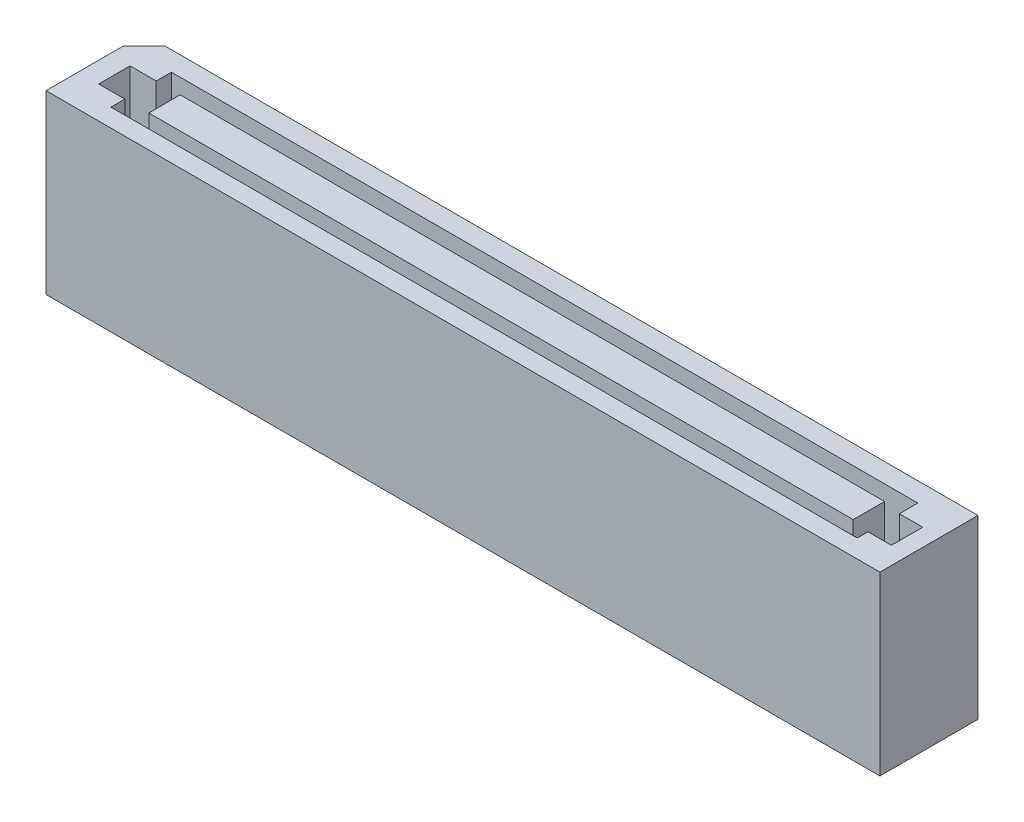
ISO-10303-21;
HEADER;
FILE_DESCRIPTION(('STEP AP214'),'2;1');
FILE_NAME('part.step','',(''),(''),'','','');
FILE_SCHEMA(('AUTOMOTIVE_DESIGN { 1 0 10303 214 1 1 1 1 }'));
ENDSEC;
DATA;
#1=APPLICATION_CONTEXT('core data for automotive mechanical design processes');
#2=APPLICATION_PROTOCOL_DEFINITION('international standard','automotive_design',2000,#1);
#3=PRODUCT_CONTEXT('',#1,'mechanical');
#4=PRODUCT('Part','Part','',(#3));
#5=PRODUCT_RELATED_PRODUCT_CATEGORY('part','',(#4));
#6=PRODUCT_DEFINITION_FORMATION('','',#4);
#7=PRODUCT_DEFINITION_CONTEXT('part definition',#1,'design');
#8=PRODUCT_DEFINITION('design','',#6,#7);
#9=PRODUCT_DEFINITION_SHAPE('','',#8);
#10=(LENGTH_UNIT() NAMED_UNIT(*) SI_UNIT(.MILLI.,.METRE.));
#11=(NAMED_UNIT(*) PLANE_ANGLE_UNIT() SI_UNIT($,.RADIAN.));
#12=(NAMED_UNIT(*) SI_UNIT($,.STERADIAN.) SOLID_ANGLE_UNIT());
#13=UNCERTAINTY_MEASURE_WITH_UNIT(LENGTH_MEASURE(1.E-05),#10,'distance_accuracy_value','');
#14=(GEOMETRIC_REPRESENTATION_CONTEXT(3) GLOBAL_UNCERTAINTY_ASSIGNED_CONTEXT((#13)) GLOBAL_UNIT_ASSIGNED_CONTEXT((#10,
#11,#12)) REPRESENTATION_CONTEXT('',''));
#15=CARTESIAN_POINT('',(0.,0.,0.));
#16=DIRECTION('',(0.,0.,1.));
#17=DIRECTION('',(1.,0.,0.));
#18=AXIS2_PLACEMENT_3D('',#15,#16,#17);
#19=CARTESIAN_POINT('',(21.25,9.,1.43999999999998));
#20=DIRECTION('',(-1.,0.,0.));
#21=DIRECTION('',(0.,0.,1.));
#22=AXIS2_PLACEMENT_3D('',#19,#20,#21);
#23=PLANE('',#22);
#24=DIRECTION('',(0.,0.,-1.));
#25=VECTOR('',#24,1.);
#26=CARTESIAN_POINT('',(21.25,0.,1.43999999999998));
#27=LINE('',#26,#25);
#28=CARTESIAN_POINT('',(21.25,0.,2.5));
#29=VERTEX_POINT('',#28);
#30=CARTESIAN_POINT('',(21.25,0.,-2.5));
#31=VERTEX_POINT('',#30);
#32=EDGE_CURVE('E290',#29,#31,#27,.T.);
#33=ORIENTED_EDGE('',*,*,#32,.T.);
#34=DIRECTION('',(0.,-1.,0.));
#35=VECTOR('',#34,1.);
#36=CARTESIAN_POINT('',(21.25,9.,-2.5));
#37=LINE('',#36,#35);
#38=CARTESIAN_POINT('',(21.25,9.,-2.5));
#39=VERTEX_POINT('',#38);
#40=EDGE_CURVE('E11',#39,#31,#37,.T.);
#41=ORIENTED_EDGE('',*,*,#40,.F.);
#42=DIRECTION('',(0.,0.,-1.));
#43=VECTOR('',#42,1.);
#44=CARTESIAN_POINT('',(21.25,9.,2.5));
#45=LINE('',#44,#43);
#46=CARTESIAN_POINT('',(21.25,9.,2.5));
#47=VERTEX_POINT('',#46);
#48=EDGE_CURVE('E312',#47,#39,#45,.T.);
#49=ORIENTED_EDGE('',*,*,#48,.F.);
#50=DIRECTION('',(0.,-1.,0.));
#51=VECTOR('',#50,1.);
#52=CARTESIAN_POINT('',(21.25,9.,2.5));
#53=LINE('',#52,#51);
#54=EDGE_CURVE('E323',#47,#29,#53,.T.);
#55=ORIENTED_EDGE('',*,*,#54,.T.);
#56=EDGE_LOOP('',(#33,#41,#49,#55));
#57=FACE_BOUND('',#56,.T.);
#58=ADVANCED_FACE('F34',(#57),#23,.F.);
#59=CARTESIAN_POINT('',(-20.189,9.,-2.5));
#60=DIRECTION('',(0.,0.,1.));
#61=DIRECTION('',(1.,0.,0.));
#62=AXIS2_PLACEMENT_3D('',#59,#60,#61);
#63=PLANE('',#62);
#64=DIRECTION('',(-1.,0.,0.));
#65=VECTOR('',#64,1.);
#66=CARTESIAN_POINT('',(-20.189,0.,-2.5));
#67=LINE('',#66,#65);
#68=CARTESIAN_POINT('',(-20.189,0.,-2.5));
#69=VERTEX_POINT('',#68);
#70=EDGE_CURVE('E325',#31,#69,#67,.T.);
#71=ORIENTED_EDGE('',*,*,#70,.T.);
#72=DIRECTION('',(0.,-1.,0.));
#73=VECTOR('',#72,1.);
#74=CARTESIAN_POINT('',(-20.189,9.,-2.5));
#75=LINE('',#74,#73);
#76=CARTESIAN_POINT('',(-20.189,9.,-2.5));
#77=VERTEX_POINT('',#76);
#78=EDGE_CURVE('E41',#77,#69,#75,.T.);
#79=ORIENTED_EDGE('',*,*,#78,.F.);
#80=DIRECTION('',(-1.,0.,0.));
#81=VECTOR('',#80,1.);
#82=CARTESIAN_POINT('',(-20.189,9.,-2.5));
#83=LINE('',#82,#81);
#84=EDGE_CURVE('E314',#39,#77,#83,.T.);
#85=ORIENTED_EDGE('',*,*,#84,.F.);
#86=ORIENTED_EDGE('',*,*,#40,.T.);
#87=EDGE_LOOP('',(#71,#79,#85,#86));
#88=FACE_BOUND('',#87,.T.);
#89=ADVANCED_FACE('F366',(#88),#63,.F.);
#90=CARTESIAN_POINT('',(-21.25,9.,-1.43900000000004));
#91=DIRECTION('',(0.707106781186547,0.,0.707106781186547));
#92=DIRECTION('',(0.707106781186548,0.,-0.707106781186548));
#93=AXIS2_PLACEMENT_3D('',#90,#91,#92);
#94=PLANE('',#93);
#95=DIRECTION('',(-0.707106781186548,0.,0.707106781186548));
#96=VECTOR('',#95,1.);
#97=CARTESIAN_POINT('',(-21.25,0.,-1.43900000000004));
#98=LINE('',#97,#96);
#99=CARTESIAN_POINT('',(-21.25,0.,-1.43900000000004));
#100=VERTEX_POINT('',#99);
#101=EDGE_CURVE('E327',#69,#100,#98,.T.);
#102=ORIENTED_EDGE('',*,*,#101,.T.);
#103=DIRECTION('',(0.,-1.,0.));
#104=VECTOR('',#103,1.);
#105=CARTESIAN_POINT('',(-21.25,9.,-1.43900000000004));
#106=LINE('',#105,#104);
#107=CARTESIAN_POINT('',(-21.25,9.,-1.43900000000004));
#108=VERTEX_POINT('',#107);
#109=EDGE_CURVE('E339',#108,#100,#106,.T.);
#110=ORIENTED_EDGE('',*,*,#109,.F.);
#111=DIRECTION('',(-0.707106781186548,0.,0.707106781186548));
#112=VECTOR('',#111,1.);
#113=CARTESIAN_POINT('',(-21.25,9.,-1.43900000000004));
#114=LINE('',#113,#112);
#115=EDGE_CURVE('E317',#77,#108,#114,.T.);
#116=ORIENTED_EDGE('',*,*,#115,.F.);
#117=ORIENTED_EDGE('',*,*,#78,.T.);
#118=EDGE_LOOP('',(#102,#110,#116,#117));
#119=FACE_BOUND('',#118,.T.);
#120=ADVANCED_FACE('F346',(#119),#94,.F.);
#121=CARTESIAN_POINT('',(-21.25,9.,-1.43900000000004));
#122=DIRECTION('',(1.,0.,0.));
#123=DIRECTION('',(0.,0.,-1.));
#124=AXIS2_PLACEMENT_3D('',#121,#122,#123);
#125=PLANE('',#124);
#126=DIRECTION('',(0.,0.,1.));
#127=VECTOR('',#126,1.);
#128=CARTESIAN_POINT('',(-21.25,0.,-1.43900000000004));
#129=LINE('',#128,#127);
#130=CARTESIAN_POINT('',(-21.25,0.,2.5));
#131=VERTEX_POINT('',#130);
#132=EDGE_CURVE('E329',#100,#131,#129,.T.);
#133=ORIENTED_EDGE('',*,*,#132,.T.);
#134=DIRECTION('',(0.,-1.,0.));
#135=VECTOR('',#134,1.);
#136=CARTESIAN_POINT('',(-21.25,9.,2.5));
#137=LINE('',#136,#135);
#138=CARTESIAN_POINT('',(-21.25,9.,2.5));
#139=VERTEX_POINT('',#138);
#140=EDGE_CURVE('E336',#139,#131,#137,.T.);
#141=ORIENTED_EDGE('',*,*,#140,.F.);
#142=DIRECTION('',(0.,0.,1.));
#143=VECTOR('',#142,1.);
#144=CARTESIAN_POINT('',(-21.25,9.,-1.43900000000004));
#145=LINE('',#144,#143);
#146=EDGE_CURVE('E319',#108,#139,#145,.T.);
#147=ORIENTED_EDGE('',*,*,#146,.F.);
#148=ORIENTED_EDGE('',*,*,#109,.T.);
#149=EDGE_LOOP('',(#133,#141,#147,#148));
#150=FACE_BOUND('',#149,.T.);
#151=ADVANCED_FACE('F356',(#150),#125,.F.);
#152=CARTESIAN_POINT('',(20.19,9.,2.5));
#153=DIRECTION('',(0.,0.,-1.));
#154=DIRECTION('',(-1.,0.,0.));
#155=AXIS2_PLACEMENT_3D('',#152,#153,#154);
#156=PLANE('',#155);
#157=DIRECTION('',(1.,0.,0.));
#158=VECTOR('',#157,1.);
#159=CARTESIAN_POINT('',(20.19,0.,2.5));
#160=LINE('',#159,#158);
#161=EDGE_CURVE('E315',#131,#29,#160,.T.);
#162=ORIENTED_EDGE('',*,*,#161,.T.);
#163=ORIENTED_EDGE('',*,*,#54,.F.);
#164=DIRECTION('',(1.,0.,0.));
#165=VECTOR('',#164,1.);
#166=CARTESIAN_POINT('',(-21.25,9.,2.5));
#167=LINE('',#166,#165);
#168=EDGE_CURVE('E321',#139,#47,#167,.T.);
#169=ORIENTED_EDGE('',*,*,#168,.F.);
#170=ORIENTED_EDGE('',*,*,#140,.T.);
#171=EDGE_LOOP('',(#162,#163,#169,#170));
#172=FACE_BOUND('',#171,.T.);
#173=ADVANCED_FACE('F360',(#172),#156,.F.);
#174=CARTESIAN_POINT('',(21.25,9.,-2.5));
#175=DIRECTION('',(0.,-1.,0.));
#176=DIRECTION('',(0.,0.,-1.));
#177=AXIS2_PLACEMENT_3D('',#174,#175,#176);
#178=PLANE('',#177);
#179=DIRECTION('',(1.,0.,0.));
#180=VECTOR('',#179,1.);
#181=CARTESIAN_POINT('',(-18.8675165970764,9.,0.862995862135563));
#182=LINE('',#181,#180);
#183=CARTESIAN_POINT('',(-20.2025173918443,9.,0.862995862135563));
#184=VERTEX_POINT('',#183);
#185=CARTESIAN_POINT('',(-18.8675165970764,9.,0.862995862135563));
#186=VERTEX_POINT('',#185);
#187=EDGE_CURVE('E256',#184,#186,#182,.T.);
#188=ORIENTED_EDGE('',*,*,#187,.F.);
#189=DIRECTION('',(0.,0.,1.));
#190=VECTOR('',#189,1.);
#191=CARTESIAN_POINT('',(-20.2025173918443,9.,0.862995862135563));
#192=LINE('',#191,#190);
#193=CARTESIAN_POINT('',(-20.2025173918443,9.,-0.734832739013314));
#194=VERTEX_POINT('',#193);
#195=EDGE_CURVE('E48',#194,#184,#192,.T.);
#196=ORIENTED_EDGE('',*,*,#195,.F.);
#197=DIRECTION('',(-1.,0.,0.));
#198=VECTOR('',#197,1.);
#199=CARTESIAN_POINT('',(-20.2025173918443,9.,-0.734832739013314));
#200=LINE('',#199,#198);
#201=CARTESIAN_POINT('',(-18.8675165970764,9.,-0.734832739013314));
#202=VERTEX_POINT('',#201);
#203=EDGE_CURVE('E221',#202,#194,#200,.T.);
#204=ORIENTED_EDGE('',*,*,#203,.F.);
#205=DIRECTION('',(0.,0.,1.));
#206=VECTOR('',#205,1.);
#207=CARTESIAN_POINT('',(-18.8675165970764,9.,-0.734832739013314));
#208=LINE('',#207,#206);
#209=CARTESIAN_POINT('',(-18.8675165970764,9.,-1.51327078955887));
#210=VERTEX_POINT('',#209);
#211=EDGE_CURVE('E283',#210,#202,#208,.T.);
#212=ORIENTED_EDGE('',*,*,#211,.F.);
#213=DIRECTION('',(-1.,0.,0.));
#214=VECTOR('',#213,1.);
#215=CARTESIAN_POINT('',(-18.8675165970764,9.,-1.51327078955887));
#216=LINE('',#215,#214);
#217=CARTESIAN_POINT('',(19.169882457141,9.,-1.51327078955887));
#218=VERTEX_POINT('',#217);
#219=EDGE_CURVE('E280',#218,#210,#216,.T.);
#220=ORIENTED_EDGE('',*,*,#219,.F.);
#221=DIRECTION('',(0.,0.,-1.));
#222=VECTOR('',#221,1.);
#223=CARTESIAN_POINT('',(19.169882457141,9.,-1.51327078955887));
#224=LINE('',#223,#222);
#225=CARTESIAN_POINT('',(19.169882457141,9.,-0.573528462546054));
#226=VERTEX_POINT('',#225);
#227=EDGE_CURVE('E277',#226,#218,#224,.T.);
#228=ORIENTED_EDGE('',*,*,#227,.F.);
#229=DIRECTION('',(-1.,0.,0.));
#230=VECTOR('',#229,1.);
#231=CARTESIAN_POINT('',(19.169882457141,9.,-0.573528462546054));
#232=LINE('',#231,#230);
#233=CARTESIAN_POINT('',(20.3611829497055,9.,-0.573528462546054));
#234=VERTEX_POINT('',#233);
#235=EDGE_CURVE('E274',#234,#226,#232,.T.);
#236=ORIENTED_EDGE('',*,*,#235,.F.);
#237=DIRECTION('',(0.,0.,-1.));
#238=VECTOR('',#237,1.);
#239=CARTESIAN_POINT('',(20.3611829497055,9.,-0.573528462546054));
#240=LINE('',#239,#238);
#241=CARTESIAN_POINT('',(20.3611829497055,9.,1.02430013860282));
#242=VERTEX_POINT('',#241);
#243=EDGE_CURVE('E271',#242,#234,#240,.T.);
#244=ORIENTED_EDGE('',*,*,#243,.F.);
#245=DIRECTION('',(1.,0.,0.));
#246=VECTOR('',#245,1.);
#247=CARTESIAN_POINT('',(20.3611829497055,9.,1.02430013860282));
#248=LINE('',#247,#246);
#249=CARTESIAN_POINT('',(19.169882457141,9.,1.02430013860282));
#250=VERTEX_POINT('',#249);
#251=EDGE_CURVE('E268',#250,#242,#248,.T.);
#252=ORIENTED_EDGE('',*,*,#251,.F.);
#253=DIRECTION('',(0.,0.,-1.));
#254=VECTOR('',#253,1.);
#255=CARTESIAN_POINT('',(19.169882457141,9.,1.02430013860282));
#256=LINE('',#255,#254);
#257=CARTESIAN_POINT('',(19.169882457141,9.,1.57234242591642));
#258=VERTEX_POINT('',#257);
#259=EDGE_CURVE('E265',#258,#250,#256,.T.);
#260=ORIENTED_EDGE('',*,*,#259,.F.);
#261=DIRECTION('',(1.,0.,0.));
#262=VECTOR('',#261,1.);
#263=CARTESIAN_POINT('',(19.169882457141,9.,1.57234242591642));
#264=LINE('',#263,#262);
#265=CARTESIAN_POINT('',(-18.8675165970764,9.,1.57234242591642));
#266=VERTEX_POINT('',#265);
#267=EDGE_CURVE('E262',#266,#258,#264,.T.);
#268=ORIENTED_EDGE('',*,*,#267,.F.);
#269=DIRECTION('',(0.,0.,1.));
#270=VECTOR('',#269,1.);
#271=CARTESIAN_POINT('',(-18.8675165970764,9.,1.57234242591642));
#272=LINE('',#271,#270);
#273=EDGE_CURVE('E259',#186,#266,#272,.T.);
#274=ORIENTED_EDGE('',*,*,#273,.F.);
#275=EDGE_LOOP('',(#188,#196,#204,#212,#220,#228,#236,#244,#252,#260,#268,#274));
#276=FACE_BOUND('',#275,.T.);
#277=ORIENTED_EDGE('',*,*,#48,.T.);
#278=ORIENTED_EDGE('',*,*,#84,.T.);
#279=ORIENTED_EDGE('',*,*,#115,.T.);
#280=ORIENTED_EDGE('',*,*,#146,.T.);
#281=ORIENTED_EDGE('',*,*,#168,.T.);
#282=EDGE_LOOP('',(#277,#278,#279,#280,#281));
#283=FACE_BOUND('',#282,.T.);
#284=ADVANCED_FACE('F364',(#276,#283),#178,.F.);
#285=CARTESIAN_POINT('',(21.25,0.,-2.5));
#286=DIRECTION('',(0.,-1.,0.));
#287=DIRECTION('',(0.,0.,-1.));
#288=AXIS2_PLACEMENT_3D('',#285,#286,#287);
#289=PLANE('',#288);
#290=ORIENTED_EDGE('',*,*,#32,.F.);
#291=ORIENTED_EDGE('',*,*,#161,.F.);
#292=ORIENTED_EDGE('',*,*,#132,.F.);
#293=ORIENTED_EDGE('',*,*,#101,.F.);
#294=ORIENTED_EDGE('',*,*,#70,.F.);
#295=EDGE_LOOP('',(#290,#291,#292,#293,#294));
#296=FACE_BOUND('',#295,.T.);
#297=ADVANCED_FACE('F353',(#296),#289,.T.);
#298=CARTESIAN_POINT('',(-20.2025173918443,5.5,0.862995862135563));
#299=DIRECTION('',(-1.,0.,0.));
#300=DIRECTION('',(0.,0.,1.));
#301=AXIS2_PLACEMENT_3D('',#298,#299,#300);
#302=PLANE('',#301);
#303=ORIENTED_EDGE('',*,*,#195,.T.);
#304=DIRECTION('',(0.,1.,0.));
#305=VECTOR('',#304,1.);
#306=CARTESIAN_POINT('',(-20.2025173918443,5.5,0.862995862135563));
#307=LINE('',#306,#305);
#308=CARTESIAN_POINT('',(-20.2025173918443,5.5,0.862995862135563));
#309=VERTEX_POINT('',#308);
#310=EDGE_CURVE('E254',#309,#184,#307,.T.);
#311=ORIENTED_EDGE('',*,*,#310,.F.);
#312=DIRECTION('',(0.,0.,1.));
#313=VECTOR('',#312,1.);
#314=CARTESIAN_POINT('',(-20.2025173918443,5.5,0.862995862135563));
#315=LINE('',#314,#313);
#316=CARTESIAN_POINT('',(-20.2025173918443,5.5,-0.734832739013314));
#317=VERTEX_POINT('',#316);
#318=EDGE_CURVE('E217',#317,#309,#315,.T.);
#319=ORIENTED_EDGE('',*,*,#318,.F.);
#320=DIRECTION('',(0.,1.,0.));
#321=VECTOR('',#320,1.);
#322=CARTESIAN_POINT('',(-20.2025173918443,5.5,-0.734832739013314));
#323=LINE('',#322,#321);
#324=EDGE_CURVE('E288',#317,#194,#323,.T.);
#325=ORIENTED_EDGE('',*,*,#324,.T.);
#326=EDGE_LOOP('',(#303,#311,#319,#325));
#327=FACE_BOUND('',#326,.T.);
#328=ADVANCED_FACE('F383',(#327),#302,.F.);
#329=CARTESIAN_POINT('',(-20.2025173918443,5.5,-0.734832739013314));
#330=DIRECTION('',(0.,0.,-1.));
#331=DIRECTION('',(-1.,0.,0.));
#332=AXIS2_PLACEMENT_3D('',#329,#330,#331);
#333=PLANE('',#332);
#334=ORIENTED_EDGE('',*,*,#203,.T.);
#335=ORIENTED_EDGE('',*,*,#324,.F.);
#336=DIRECTION('',(-1.,0.,0.));
#337=VECTOR('',#336,1.);
#338=CARTESIAN_POINT('',(-20.2025173918443,5.5,-0.734832739013314));
#339=LINE('',#338,#337);
#340=CARTESIAN_POINT('',(-18.8675165970764,5.5,-0.734832739013314));
#341=VERTEX_POINT('',#340);
#342=EDGE_CURVE('E251',#341,#317,#339,.T.);
#343=ORIENTED_EDGE('',*,*,#342,.F.);
#344=DIRECTION('',(0.,1.,0.));
#345=VECTOR('',#344,1.);
#346=CARTESIAN_POINT('',(-18.8675165970764,5.5,-0.734832739013314));
#347=LINE('',#346,#345);
#348=EDGE_CURVE('E291',#341,#202,#347,.T.);
#349=ORIENTED_EDGE('',*,*,#348,.T.);
#350=EDGE_LOOP('',(#334,#335,#343,#349));
#351=FACE_BOUND('',#350,.T.);
#352=ADVANCED_FACE('F390',(#351),#333,.F.);
#353=CARTESIAN_POINT('',(-18.8675165970764,5.5,-0.734832739013314));
#354=DIRECTION('',(-1.,0.,0.));
#355=DIRECTION('',(0.,0.,1.));
#356=AXIS2_PLACEMENT_3D('',#353,#354,#355);
#357=PLANE('',#356);
#358=ORIENTED_EDGE('',*,*,#211,.T.);
#359=ORIENTED_EDGE('',*,*,#348,.F.);
#360=DIRECTION('',(0.,0.,1.));
#361=VECTOR('',#360,1.);
#362=CARTESIAN_POINT('',(-18.8675165970764,5.5,-0.734832739013314));
#363=LINE('',#362,#361);
#364=CARTESIAN_POINT('',(-18.8675165970764,5.5,-1.51327078955887));
#365=VERTEX_POINT('',#364);
#366=EDGE_CURVE('E248',#365,#341,#363,.T.);
#367=ORIENTED_EDGE('',*,*,#366,.F.);
#368=DIRECTION('',(0.,1.,0.));
#369=VECTOR('',#368,1.);
#370=CARTESIAN_POINT('',(-18.8675165970764,5.5,-1.51327078955887));
#371=LINE('',#370,#369);
#372=EDGE_CURVE('E293',#365,#210,#371,.T.);
#373=ORIENTED_EDGE('',*,*,#372,.T.);
#374=EDGE_LOOP('',(#358,#359,#367,#373));
#375=FACE_BOUND('',#374,.T.);
#376=ADVANCED_FACE('F426',(#375),#357,.F.);
#377=CARTESIAN_POINT('',(-18.8675165970764,5.5,-1.51327078955887));
#378=DIRECTION('',(0.,0.,-1.));
#379=DIRECTION('',(-1.,0.,0.));
#380=AXIS2_PLACEMENT_3D('',#377,#378,#379);
#381=PLANE('',#380);
#382=ORIENTED_EDGE('',*,*,#219,.T.);
#383=ORIENTED_EDGE('',*,*,#372,.F.);
#384=DIRECTION('',(-1.,0.,0.));
#385=VECTOR('',#384,1.);
#386=CARTESIAN_POINT('',(-18.8675165970764,5.5,-1.51327078955887));
#387=LINE('',#386,#385);
#388=CARTESIAN_POINT('',(19.169882457141,5.5,-1.51327078955887));
#389=VERTEX_POINT('',#388);
#390=EDGE_CURVE('E245',#389,#365,#387,.T.);
#391=ORIENTED_EDGE('',*,*,#390,.F.);
#392=DIRECTION('',(0.,1.,0.));
#393=VECTOR('',#392,1.);
#394=CARTESIAN_POINT('',(19.169882457141,5.5,-1.51327078955887));
#395=LINE('',#394,#393);
#396=EDGE_CURVE('E295',#389,#218,#395,.T.);
#397=ORIENTED_EDGE('',*,*,#396,.T.);
#398=EDGE_LOOP('',(#382,#383,#391,#397));
#399=FACE_BOUND('',#398,.T.);
#400=ADVANCED_FACE('F422',(#399),#381,.F.);
#401=CARTESIAN_POINT('',(19.169882457141,5.5,-1.51327078955887));
#402=DIRECTION('',(1.,0.,0.));
#403=DIRECTION('',(0.,0.,-1.));
#404=AXIS2_PLACEMENT_3D('',#401,#402,#403);
#405=PLANE('',#404);
#406=ORIENTED_EDGE('',*,*,#227,.T.);
#407=ORIENTED_EDGE('',*,*,#396,.F.);
#408=DIRECTION('',(0.,0.,-1.));
#409=VECTOR('',#408,1.);
#410=CARTESIAN_POINT('',(19.169882457141,5.5,-1.51327078955887));
#411=LINE('',#410,#409);
#412=CARTESIAN_POINT('',(19.169882457141,5.5,-0.573528462546054));
#413=VERTEX_POINT('',#412);
#414=EDGE_CURVE('E242',#413,#389,#411,.T.);
#415=ORIENTED_EDGE('',*,*,#414,.F.);
#416=DIRECTION('',(0.,1.,0.));
#417=VECTOR('',#416,1.);
#418=CARTESIAN_POINT('',(19.169882457141,5.5,-0.573528462546054));
#419=LINE('',#418,#417);
#420=EDGE_CURVE('E297',#413,#226,#419,.T.);
#421=ORIENTED_EDGE('',*,*,#420,.T.);
#422=EDGE_LOOP('',(#406,#407,#415,#421));
#423=FACE_BOUND('',#422,.T.);
#424=ADVANCED_FACE('F418',(#423),#405,.F.);
#425=CARTESIAN_POINT('',(19.169882457141,5.5,-0.573528462546054));
#426=DIRECTION('',(0.,0.,-1.));
#427=DIRECTION('',(-1.,0.,0.));
#428=AXIS2_PLACEMENT_3D('',#425,#426,#427);
#429=PLANE('',#428);
#430=ORIENTED_EDGE('',*,*,#235,.T.);
#431=ORIENTED_EDGE('',*,*,#420,.F.);
#432=DIRECTION('',(-1.,0.,0.));
#433=VECTOR('',#432,1.);
#434=CARTESIAN_POINT('',(19.169882457141,5.5,-0.573528462546054));
#435=LINE('',#434,#433);
#436=CARTESIAN_POINT('',(20.3611829497055,5.5,-0.573528462546054));
#437=VERTEX_POINT('',#436);
#438=EDGE_CURVE('E239',#437,#413,#435,.T.);
#439=ORIENTED_EDGE('',*,*,#438,.F.);
#440=DIRECTION('',(0.,1.,0.));
#441=VECTOR('',#440,1.);
#442=CARTESIAN_POINT('',(20.3611829497055,5.5,-0.573528462546054));
#443=LINE('',#442,#441);
#444=EDGE_CURVE('E299',#437,#234,#443,.T.);
#445=ORIENTED_EDGE('',*,*,#444,.T.);
#446=EDGE_LOOP('',(#430,#431,#439,#445));
#447=FACE_BOUND('',#446,.T.);
#448=ADVANCED_FACE('F414',(#447),#429,.F.);
#449=CARTESIAN_POINT('',(20.3611829497055,5.5,-0.573528462546054));
#450=DIRECTION('',(1.,0.,0.));
#451=DIRECTION('',(0.,0.,-1.));
#452=AXIS2_PLACEMENT_3D('',#449,#450,#451);
#453=PLANE('',#452);
#454=ORIENTED_EDGE('',*,*,#243,.T.);
#455=ORIENTED_EDGE('',*,*,#444,.F.);
#456=DIRECTION('',(0.,0.,-1.));
#457=VECTOR('',#456,1.);
#458=CARTESIAN_POINT('',(20.3611829497055,5.5,-0.573528462546054));
#459=LINE('',#458,#457);
#460=CARTESIAN_POINT('',(20.3611829497055,5.5,1.02430013860282));
#461=VERTEX_POINT('',#460);
#462=EDGE_CURVE('E236',#461,#437,#459,.T.);
#463=ORIENTED_EDGE('',*,*,#462,.F.);
#464=DIRECTION('',(0.,1.,0.));
#465=VECTOR('',#464,1.);
#466=CARTESIAN_POINT('',(20.3611829497055,5.5,1.02430013860282));
#467=LINE('',#466,#465);
#468=EDGE_CURVE('E301',#461,#242,#467,.T.);
#469=ORIENTED_EDGE('',*,*,#468,.T.);
#470=EDGE_LOOP('',(#454,#455,#463,#469));
#471=FACE_BOUND('',#470,.T.);
#472=ADVANCED_FACE('F410',(#471),#453,.F.);
#473=CARTESIAN_POINT('',(20.3611829497055,5.5,1.02430013860282));
#474=DIRECTION('',(0.,0.,1.));
#475=DIRECTION('',(1.,0.,0.));
#476=AXIS2_PLACEMENT_3D('',#473,#474,#475);
#477=PLANE('',#476);
#478=ORIENTED_EDGE('',*,*,#251,.T.);
#479=ORIENTED_EDGE('',*,*,#468,.F.);
#480=DIRECTION('',(1.,0.,0.));
#481=VECTOR('',#480,1.);
#482=CARTESIAN_POINT('',(20.3611829497055,5.5,1.02430013860282));
#483=LINE('',#482,#481);
#484=CARTESIAN_POINT('',(19.169882457141,5.5,1.02430013860282));
#485=VERTEX_POINT('',#484);
#486=EDGE_CURVE('E233',#485,#461,#483,.T.);
#487=ORIENTED_EDGE('',*,*,#486,.F.);
#488=DIRECTION('',(0.,1.,0.));
#489=VECTOR('',#488,1.);
#490=CARTESIAN_POINT('',(19.169882457141,5.5,1.02430013860282));
#491=LINE('',#490,#489);
#492=EDGE_CURVE('E303',#485,#250,#491,.T.);
#493=ORIENTED_EDGE('',*,*,#492,.T.);
#494=EDGE_LOOP('',(#478,#479,#487,#493));
#495=FACE_BOUND('',#494,.T.);
#496=ADVANCED_FACE('F406',(#495),#477,.F.);
#497=CARTESIAN_POINT('',(19.169882457141,5.5,1.02430013860282));
#498=DIRECTION('',(1.,0.,0.));
#499=DIRECTION('',(0.,0.,-1.));
#500=AXIS2_PLACEMENT_3D('',#497,#498,#499);
#501=PLANE('',#500);
#502=ORIENTED_EDGE('',*,*,#259,.T.);
#503=ORIENTED_EDGE('',*,*,#492,.F.);
#504=DIRECTION('',(0.,0.,-1.));
#505=VECTOR('',#504,1.);
#506=CARTESIAN_POINT('',(19.169882457141,5.5,1.02430013860282));
#507=LINE('',#506,#505);
#508=CARTESIAN_POINT('',(19.169882457141,5.5,1.57234242591642));
#509=VERTEX_POINT('',#508);
#510=EDGE_CURVE('E230',#509,#485,#507,.T.);
#511=ORIENTED_EDGE('',*,*,#510,.F.);
#512=DIRECTION('',(0.,1.,0.));
#513=VECTOR('',#512,1.);
#514=CARTESIAN_POINT('',(19.169882457141,5.5,1.57234242591642));
#515=LINE('',#514,#513);
#516=EDGE_CURVE('E305',#509,#258,#515,.T.);
#517=ORIENTED_EDGE('',*,*,#516,.T.);
#518=EDGE_LOOP('',(#502,#503,#511,#517));
#519=FACE_BOUND('',#518,.T.);
#520=ADVANCED_FACE('F402',(#519),#501,.F.);
#521=CARTESIAN_POINT('',(19.169882457141,5.5,1.57234242591642));
#522=DIRECTION('',(0.,0.,1.));
#523=DIRECTION('',(1.,0.,0.));
#524=AXIS2_PLACEMENT_3D('',#521,#522,#523);
#525=PLANE('',#524);
#526=ORIENTED_EDGE('',*,*,#267,.T.);
#527=ORIENTED_EDGE('',*,*,#516,.F.);
#528=DIRECTION('',(1.,0.,0.));
#529=VECTOR('',#528,1.);
#530=CARTESIAN_POINT('',(19.169882457141,5.5,1.57234242591642));
#531=LINE('',#530,#529);
#532=CARTESIAN_POINT('',(-18.8675165970764,5.5,1.57234242591642));
#533=VERTEX_POINT('',#532);
#534=EDGE_CURVE('E227',#533,#509,#531,.T.);
#535=ORIENTED_EDGE('',*,*,#534,.F.);
#536=DIRECTION('',(0.,1.,0.));
#537=VECTOR('',#536,1.);
#538=CARTESIAN_POINT('',(-18.8675165970764,5.5,1.57234242591642));
#539=LINE('',#538,#537);
#540=EDGE_CURVE('E307',#533,#266,#539,.T.);
#541=ORIENTED_EDGE('',*,*,#540,.T.);
#542=EDGE_LOOP('',(#526,#527,#535,#541));
#543=FACE_BOUND('',#542,.T.);
#544=ADVANCED_FACE('F398',(#543),#525,.F.);
#545=CARTESIAN_POINT('',(-18.8675165970764,5.5,1.57234242591642));
#546=DIRECTION('',(-1.,0.,0.));
#547=DIRECTION('',(0.,0.,1.));
#548=AXIS2_PLACEMENT_3D('',#545,#546,#547);
#549=PLANE('',#548);
#550=ORIENTED_EDGE('',*,*,#273,.T.);
#551=ORIENTED_EDGE('',*,*,#540,.F.);
#552=DIRECTION('',(0.,0.,1.));
#553=VECTOR('',#552,1.);
#554=CARTESIAN_POINT('',(-18.8675165970764,5.5,1.57234242591642));
#555=LINE('',#554,#553);
#556=CARTESIAN_POINT('',(-18.8675165970764,5.5,0.862995862135563));
#557=VERTEX_POINT('',#556);
#558=EDGE_CURVE('E224',#557,#533,#555,.T.);
#559=ORIENTED_EDGE('',*,*,#558,.F.);
#560=DIRECTION('',(0.,1.,0.));
#561=VECTOR('',#560,1.);
#562=CARTESIAN_POINT('',(-18.8675165970764,5.5,0.862995862135563));
#563=LINE('',#562,#561);
#564=EDGE_CURVE('E309',#557,#186,#563,.T.);
#565=ORIENTED_EDGE('',*,*,#564,.T.);
#566=EDGE_LOOP('',(#550,#551,#559,#565));
#567=FACE_BOUND('',#566,.T.);
#568=ADVANCED_FACE('F394',(#567),#549,.F.);
#569=CARTESIAN_POINT('',(-18.8675165970764,5.5,0.862995862135563));
#570=DIRECTION('',(0.,0.,1.));
#571=DIRECTION('',(1.,0.,0.));
#572=AXIS2_PLACEMENT_3D('',#569,#570,#571);
#573=PLANE('',#572);
#574=ORIENTED_EDGE('',*,*,#187,.T.);
#575=ORIENTED_EDGE('',*,*,#564,.F.);
#576=DIRECTION('',(1.,0.,0.));
#577=VECTOR('',#576,1.);
#578=CARTESIAN_POINT('',(-18.8675165970764,5.5,0.862995862135563));
#579=LINE('',#578,#577);
#580=EDGE_CURVE('E220',#309,#557,#579,.T.);
#581=ORIENTED_EDGE('',*,*,#580,.F.);
#582=ORIENTED_EDGE('',*,*,#310,.T.);
#583=EDGE_LOOP('',(#574,#575,#581,#582));
#584=FACE_BOUND('',#583,.T.);
#585=ADVANCED_FACE('F391',(#584),#573,.F.);
#586=CARTESIAN_POINT('',(0.,5.5,0.));
#587=DIRECTION('',(0.,-1.,0.));
#588=DIRECTION('',(0.,0.,-1.));
#589=AXIS2_PLACEMENT_3D('',#586,#587,#588);
#590=PLANE('',#589);
#591=DIRECTION('',(0.,0.,1.));
#592=VECTOR('',#591,1.);
#593=CARTESIAN_POINT('',(-17.6447271917865,5.5,-0.734832739013314));
#594=LINE('',#593,#592);
#595=CARTESIAN_POINT('',(-17.6447271917865,5.5,-0.734832739013314));
#596=VERTEX_POINT('',#595);
#597=CARTESIAN_POINT('',(-17.6447271917865,5.5,0.862995862135563));
#598=VERTEX_POINT('',#597);
#599=EDGE_CURVE('E195',#596,#598,#594,.T.);
#600=ORIENTED_EDGE('',*,*,#599,.F.);
#601=DIRECTION('',(-1.,0.,0.));
#602=VECTOR('',#601,1.);
#603=CARTESIAN_POINT('',(-17.6447271917865,5.5,-0.734832739013314));
#604=LINE('',#603,#602);
#605=CARTESIAN_POINT('',(18.2530357666116,5.5,-0.734832739013314));
#606=VERTEX_POINT('',#605);
#607=EDGE_CURVE('E188',#606,#596,#604,.T.);
#608=ORIENTED_EDGE('',*,*,#607,.F.);
#609=DIRECTION('',(0.,0.,-1.));
#610=VECTOR('',#609,1.);
#611=CARTESIAN_POINT('',(18.2530357666116,5.5,-0.734832739013314));
#612=LINE('',#611,#610);
#613=CARTESIAN_POINT('',(18.2530357666116,5.5,0.862995862135563));
#614=VERTEX_POINT('',#613);
#615=EDGE_CURVE('E198',#614,#606,#612,.T.);
#616=ORIENTED_EDGE('',*,*,#615,.F.);
#617=DIRECTION('',(1.,0.,0.));
#618=VECTOR('',#617,1.);
#619=CARTESIAN_POINT('',(-17.6447271917865,5.5,0.862995862135563));
#620=LINE('',#619,#618);
#621=EDGE_CURVE('E180',#598,#614,#620,.T.);
#622=ORIENTED_EDGE('',*,*,#621,.F.);
#623=EDGE_LOOP('',(#600,#608,#616,#622));
#624=FACE_BOUND('',#623,.T.);
#625=ORIENTED_EDGE('',*,*,#318,.T.);
#626=ORIENTED_EDGE('',*,*,#580,.T.);
#627=ORIENTED_EDGE('',*,*,#558,.T.);
#628=ORIENTED_EDGE('',*,*,#534,.T.);
#629=ORIENTED_EDGE('',*,*,#510,.T.);
#630=ORIENTED_EDGE('',*,*,#486,.T.);
#631=ORIENTED_EDGE('',*,*,#462,.T.);
#632=ORIENTED_EDGE('',*,*,#438,.T.);
#633=ORIENTED_EDGE('',*,*,#414,.T.);
#634=ORIENTED_EDGE('',*,*,#390,.T.);
#635=ORIENTED_EDGE('',*,*,#366,.T.);
#636=ORIENTED_EDGE('',*,*,#342,.T.);
#637=EDGE_LOOP('',(#625,#626,#627,#628,#629,#630,#631,#632,#633,#634,#635,#636));
#638=FACE_BOUND('',#637,.T.);
#639=ADVANCED_FACE('F192',(#624,#638),#590,.F.);
#640=CARTESIAN_POINT('',(-17.6447271917865,5.5,-0.734832739013314));
#641=DIRECTION('',(-1.,0.,0.));
#642=DIRECTION('',(0.,0.,1.));
#643=AXIS2_PLACEMENT_3D('',#640,#641,#642);
#644=PLANE('',#643);
#645=DIRECTION('',(0.,0.,1.));
#646=VECTOR('',#645,1.);
#647=CARTESIAN_POINT('',(-17.6447271917865,9.,-0.734832739013314));
#648=LINE('',#647,#646);
#649=CARTESIAN_POINT('',(-17.6447271917865,9.,-0.734832739013314));
#650=VERTEX_POINT('',#649);
#651=CARTESIAN_POINT('',(-17.6447271917865,9.,0.862995862135563));
#652=VERTEX_POINT('',#651);
#653=EDGE_CURVE('E209',#650,#652,#648,.T.);
#654=ORIENTED_EDGE('',*,*,#653,.F.);
#655=DIRECTION('',(0.,1.,0.));
#656=VECTOR('',#655,1.);
#657=CARTESIAN_POINT('',(-17.6447271917865,5.5,-0.734832739013314));
#658=LINE('',#657,#656);
#659=EDGE_CURVE('E201',#596,#650,#658,.T.);
#660=ORIENTED_EDGE('',*,*,#659,.F.);
#661=ORIENTED_EDGE('',*,*,#599,.T.);
#662=DIRECTION('',(0.,1.,0.));
#663=VECTOR('',#662,1.);
#664=CARTESIAN_POINT('',(-17.6447271917865,5.5,0.862995862135563));
#665=LINE('',#664,#663);
#666=EDGE_CURVE('E177',#598,#652,#665,.T.);
#667=ORIENTED_EDGE('',*,*,#666,.T.);
#668=EDGE_LOOP('',(#654,#660,#661,#667));
#669=FACE_BOUND('',#668,.T.);
#670=ADVANCED_FACE('F200',(#669),#644,.T.);
#671=CARTESIAN_POINT('',(-17.6447271917865,5.5,-0.734832739013314));
#672=DIRECTION('',(0.,0.,-1.));
#673=DIRECTION('',(-1.,0.,0.));
#674=AXIS2_PLACEMENT_3D('',#671,#672,#673);
#675=PLANE('',#674);
#676=DIRECTION('',(-1.,0.,0.));
#677=VECTOR('',#676,1.);
#678=CARTESIAN_POINT('',(-17.6447271917865,9.,-0.734832739013314));
#679=LINE('',#678,#677);
#680=CARTESIAN_POINT('',(18.2530357666116,9.,-0.734832739013314));
#681=VERTEX_POINT('',#680);
#682=EDGE_CURVE('E202',#681,#650,#679,.T.);
#683=ORIENTED_EDGE('',*,*,#682,.F.);
#684=DIRECTION('',(0.,1.,0.));
#685=VECTOR('',#684,1.);
#686=CARTESIAN_POINT('',(18.2530357666116,5.5,-0.734832739013314));
#687=LINE('',#686,#685);
#688=EDGE_CURVE('E214',#606,#681,#687,.T.);
#689=ORIENTED_EDGE('',*,*,#688,.F.);
#690=ORIENTED_EDGE('',*,*,#607,.T.);
#691=ORIENTED_EDGE('',*,*,#659,.T.);
#692=EDGE_LOOP('',(#683,#689,#690,#691));
#693=FACE_BOUND('',#692,.T.);
#694=ADVANCED_FACE('F438',(#693),#675,.T.);
#695=CARTESIAN_POINT('',(18.2530357666116,5.5,-0.734832739013314));
#696=DIRECTION('',(1.,0.,0.));
#697=DIRECTION('',(0.,0.,-1.));
#698=AXIS2_PLACEMENT_3D('',#695,#696,#697);
#699=PLANE('',#698);
#700=DIRECTION('',(0.,0.,-1.));
#701=VECTOR('',#700,1.);
#702=CARTESIAN_POINT('',(18.2530357666116,9.,-0.734832739013314));
#703=LINE('',#702,#701);
#704=CARTESIAN_POINT('',(18.2530357666116,9.,0.862995862135563));
#705=VERTEX_POINT('',#704);
#706=EDGE_CURVE('E56',#705,#681,#703,.T.);
#707=ORIENTED_EDGE('',*,*,#706,.F.);
#708=DIRECTION('',(0.,1.,0.));
#709=VECTOR('',#708,1.);
#710=CARTESIAN_POINT('',(18.2530357666116,5.5,0.862995862135563));
#711=LINE('',#710,#709);
#712=EDGE_CURVE('E187',#614,#705,#711,.T.);
#713=ORIENTED_EDGE('',*,*,#712,.F.);
#714=ORIENTED_EDGE('',*,*,#615,.T.);
#715=ORIENTED_EDGE('',*,*,#688,.T.);
#716=EDGE_LOOP('',(#707,#713,#714,#715));
#717=FACE_BOUND('',#716,.T.);
#718=ADVANCED_FACE('F441',(#717),#699,.T.);
#719=CARTESIAN_POINT('',(-17.6447271917865,5.5,0.862995862135563));
#720=DIRECTION('',(0.,0.,1.));
#721=DIRECTION('',(1.,0.,0.));
#722=AXIS2_PLACEMENT_3D('',#719,#720,#721);
#723=PLANE('',#722);
#724=DIRECTION('',(1.,0.,0.));
#725=VECTOR('',#724,1.);
#726=CARTESIAN_POINT('',(-17.6447271917865,9.,0.862995862135563));
#727=LINE('',#726,#725);
#728=EDGE_CURVE('E182',#652,#705,#727,.T.);
#729=ORIENTED_EDGE('',*,*,#728,.F.);
#730=ORIENTED_EDGE('',*,*,#666,.F.);
#731=ORIENTED_EDGE('',*,*,#621,.T.);
#732=ORIENTED_EDGE('',*,*,#712,.T.);
#733=EDGE_LOOP('',(#729,#730,#731,#732));
#734=FACE_BOUND('',#733,.T.);
#735=ADVANCED_FACE('F179',(#734),#723,.T.);
#736=ORIENTED_EDGE('',*,*,#653,.T.);
#737=ORIENTED_EDGE('',*,*,#728,.T.);
#738=ORIENTED_EDGE('',*,*,#706,.T.);
#739=ORIENTED_EDGE('',*,*,#682,.T.);
#740=EDGE_LOOP('',(#736,#737,#738,#739));
#741=FACE_BOUND('',#740,.T.);
#742=ADVANCED_FACE('F387',(#741),#178,.F.);
#743=CLOSED_SHELL('',(#58,#89,#120,#151,#173,#284,#297,#328,#352,#376,#400,#424,#448,#472,#496,
#520,#544,#568,#585,#639,#670,#694,#718,#735,#742));
#744=MANIFOLD_SOLID_BREP('B2',#743);
#745=ADVANCED_BREP_SHAPE_REPRESENTATION('',(#18,#744),#14);
#746=SHAPE_DEFINITION_REPRESENTATION(#9,#745);
ENDSEC;
END-ISO-10303-21;
